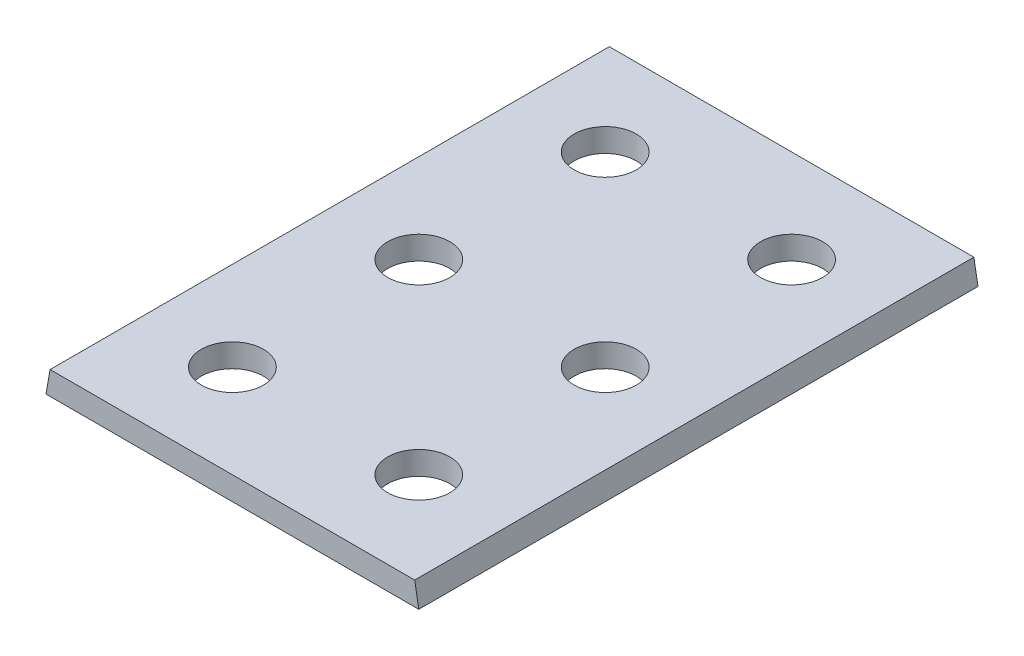
ISO-10303-21;
HEADER;
FILE_DESCRIPTION(('STEP AP214'),'2;1');
FILE_NAME('part.step','',(''),(''),'','','');
FILE_SCHEMA(('AUTOMOTIVE_DESIGN { 1 0 10303 214 1 1 1 1 }'));
ENDSEC;
DATA;
#1=APPLICATION_CONTEXT('core data for automotive mechanical design processes');
#2=APPLICATION_PROTOCOL_DEFINITION('international standard','automotive_design',2000,#1);
#3=PRODUCT_CONTEXT('',#1,'mechanical');
#4=PRODUCT('Part','Part','',(#3));
#5=PRODUCT_RELATED_PRODUCT_CATEGORY('part','',(#4));
#6=PRODUCT_DEFINITION_FORMATION('','',#4);
#7=PRODUCT_DEFINITION_CONTEXT('part definition',#1,'design');
#8=PRODUCT_DEFINITION('design','',#6,#7);
#9=PRODUCT_DEFINITION_SHAPE('','',#8);
#10=(LENGTH_UNIT() NAMED_UNIT(*) SI_UNIT(.MILLI.,.METRE.));
#11=(NAMED_UNIT(*) PLANE_ANGLE_UNIT() SI_UNIT($,.RADIAN.));
#12=(NAMED_UNIT(*) SI_UNIT($,.STERADIAN.) SOLID_ANGLE_UNIT());
#13=UNCERTAINTY_MEASURE_WITH_UNIT(LENGTH_MEASURE(1.E-05),#10,'distance_accuracy_value','');
#14=(GEOMETRIC_REPRESENTATION_CONTEXT(3) GLOBAL_UNCERTAINTY_ASSIGNED_CONTEXT((#13)) GLOBAL_UNIT_ASSIGNED_CONTEXT((#10,
#11,#12)) REPRESENTATION_CONTEXT('',''));
#15=CARTESIAN_POINT('',(0.,0.,0.));
#16=DIRECTION('',(0.,0.,1.));
#17=DIRECTION('',(1.,0.,0.));
#18=AXIS2_PLACEMENT_3D('',#15,#16,#17);
#19=CARTESIAN_POINT('',(0.,6.75,0.));
#20=DIRECTION('',(0.,-1.,0.));
#21=DIRECTION('',(0.,0.,-1.));
#22=AXIS2_PLACEMENT_3D('',#19,#20,#21);
#23=PLANE('',#22);
#24=DIRECTION('',(1.,0.,0.));
#25=VECTOR('',#24,1.);
#26=CARTESIAN_POINT('',(-45.4205607476636,6.75,63.588785046729));
#27=LINE('',#26,#25);
#28=CARTESIAN_POINT('',(-44.2303536278814,6.75,63.588785046729));
#29=VERTEX_POINT('',#28);
#30=CARTESIAN_POINT('',(61.3892321325543,6.75,63.588785046729));
#31=VERTEX_POINT('',#30);
#32=EDGE_CURVE('E89',#29,#31,#27,.T.);
#33=ORIENTED_EDGE('',*,*,#32,.T.);
#34=DIRECTION('',(0.,0.,-1.));
#35=VECTOR('',#34,1.);
#36=CARTESIAN_POINT('',(61.3892321325543,6.75,0.));
#37=LINE('',#36,#35);
#38=CARTESIAN_POINT('',(61.3892321325543,6.75,-98.411214953271));
#39=VERTEX_POINT('',#38);
#40=EDGE_CURVE('E113',#31,#39,#37,.T.);
#41=ORIENTED_EDGE('',*,*,#40,.T.);
#42=DIRECTION('',(-1.,0.,0.));
#43=VECTOR('',#42,1.);
#44=CARTESIAN_POINT('',(-45.4205607476636,6.75,-98.411214953271));
#45=LINE('',#44,#43);
#46=CARTESIAN_POINT('',(-44.2303536278814,6.75,-98.411214953271));
#47=VERTEX_POINT('',#46);
#48=EDGE_CURVE('E106',#39,#47,#45,.T.);
#49=ORIENTED_EDGE('',*,*,#48,.T.);
#50=DIRECTION('',(0.,0.,1.));
#51=VECTOR('',#50,1.);
#52=CARTESIAN_POINT('',(-44.2303536278814,6.75,0.));
#53=LINE('',#52,#51);
#54=EDGE_CURVE('E111',#47,#29,#53,.T.);
#55=ORIENTED_EDGE('',*,*,#54,.T.);
#56=EDGE_LOOP('',(#33,#41,#49,#55));
#57=FACE_BOUND('',#56,.T.);
#58=CARTESIAN_POINT('',(-18.4205607476636,6.75,36.588785046729));
#59=DIRECTION('',(0.,1.,0.));
#60=DIRECTION('',(0.,0.,1.));
#61=AXIS2_PLACEMENT_3D('',#58,#59,#60);
#62=CIRCLE('',#61,9.);
#63=CARTESIAN_POINT('',(-18.4205607476636,6.75,45.588785046729));
#64=VERTEX_POINT('',#63);
#65=EDGE_CURVE('E102',#64,#64,#62,.T.);
#66=ORIENTED_EDGE('',*,*,#65,.F.);
#67=EDGE_LOOP('',(#66));
#68=FACE_BOUND('',#67,.T.);
#69=CARTESIAN_POINT('',(-18.4205607476636,6.75,-17.411214953271));
#70=DIRECTION('',(0.,1.,0.));
#71=DIRECTION('',(0.,0.,1.));
#72=AXIS2_PLACEMENT_3D('',#69,#70,#71);
#73=CIRCLE('',#72,9.);
#74=CARTESIAN_POINT('',(-18.4205607476636,6.75,-8.41121495327099));
#75=VERTEX_POINT('',#74);
#76=EDGE_CURVE('E123',#75,#75,#73,.T.);
#77=ORIENTED_EDGE('',*,*,#76,.F.);
#78=EDGE_LOOP('',(#77));
#79=FACE_BOUND('',#78,.T.);
#80=CARTESIAN_POINT('',(35.5794392523364,6.75,-71.411214953271));
#81=DIRECTION('',(0.,1.,0.));
#82=DIRECTION('',(0.,0.,-1.));
#83=AXIS2_PLACEMENT_3D('',#80,#81,#82);
#84=CIRCLE('',#83,9.);
#85=CARTESIAN_POINT('',(35.5794392523364,6.75,-80.411214953271));
#86=VERTEX_POINT('',#85);
#87=EDGE_CURVE('E129',#86,#86,#84,.T.);
#88=ORIENTED_EDGE('',*,*,#87,.F.);
#89=EDGE_LOOP('',(#88));
#90=FACE_BOUND('',#89,.T.);
#91=CARTESIAN_POINT('',(-18.4205607476636,6.75,-71.411214953271));
#92=DIRECTION('',(0.,1.,0.));
#93=DIRECTION('',(0.,0.,1.));
#94=AXIS2_PLACEMENT_3D('',#91,#92,#93);
#95=CIRCLE('',#94,9.);
#96=CARTESIAN_POINT('',(-18.4205607476636,6.75,-62.411214953271));
#97=VERTEX_POINT('',#96);
#98=EDGE_CURVE('E135',#97,#97,#95,.T.);
#99=ORIENTED_EDGE('',*,*,#98,.F.);
#100=EDGE_LOOP('',(#99));
#101=FACE_BOUND('',#100,.T.);
#102=CARTESIAN_POINT('',(35.5794392523364,6.75,-17.411214953271));
#103=DIRECTION('',(0.,1.,0.));
#104=DIRECTION('',(0.,0.,-1.));
#105=AXIS2_PLACEMENT_3D('',#102,#103,#104);
#106=CIRCLE('',#105,9.);
#107=CARTESIAN_POINT('',(35.5794392523364,6.75,-26.411214953271));
#108=VERTEX_POINT('',#107);
#109=EDGE_CURVE('E141',#108,#108,#106,.T.);
#110=ORIENTED_EDGE('',*,*,#109,.F.);
#111=EDGE_LOOP('',(#110));
#112=FACE_BOUND('',#111,.T.);
#113=CARTESIAN_POINT('',(35.5794392523364,6.75,36.588785046729));
#114=DIRECTION('',(0.,1.,0.));
#115=DIRECTION('',(0.,0.,-1.));
#116=AXIS2_PLACEMENT_3D('',#113,#114,#115);
#117=CIRCLE('',#116,9.);
#118=CARTESIAN_POINT('',(35.5794392523364,6.75,27.588785046729));
#119=VERTEX_POINT('',#118);
#120=EDGE_CURVE('E147',#119,#119,#117,.T.);
#121=ORIENTED_EDGE('',*,*,#120,.F.);
#122=EDGE_LOOP('',(#121));
#123=FACE_BOUND('',#122,.T.);
#124=ADVANCED_FACE('F42',(#57,#68,#79,#90,#101,#112,#123),#23,.F.);
#125=CARTESIAN_POINT('',(0.,0.,0.));
#126=DIRECTION('',(0.,-1.,0.));
#127=DIRECTION('',(0.,0.,-1.));
#128=AXIS2_PLACEMENT_3D('',#125,#126,#127);
#129=PLANE('',#128);
#130=CARTESIAN_POINT('',(35.5794392523364,0.,-17.411214953271));
#131=DIRECTION('',(0.,1.,0.));
#132=DIRECTION('',(0.,0.,-1.));
#133=AXIS2_PLACEMENT_3D('',#130,#131,#132);
#134=CIRCLE('',#133,9.);
#135=CARTESIAN_POINT('',(35.5794392523364,0.,-26.411214953271));
#136=VERTEX_POINT('',#135);
#137=EDGE_CURVE('E144',#136,#136,#134,.T.);
#138=ORIENTED_EDGE('',*,*,#137,.T.);
#139=EDGE_LOOP('',(#138));
#140=FACE_BOUND('',#139,.T.);
#141=CARTESIAN_POINT('',(35.5794392523364,0.,-71.411214953271));
#142=DIRECTION('',(0.,1.,0.));
#143=DIRECTION('',(0.,0.,-1.));
#144=AXIS2_PLACEMENT_3D('',#141,#142,#143);
#145=CIRCLE('',#144,9.);
#146=CARTESIAN_POINT('',(35.5794392523364,0.,-80.411214953271));
#147=VERTEX_POINT('',#146);
#148=EDGE_CURVE('E132',#147,#147,#145,.T.);
#149=ORIENTED_EDGE('',*,*,#148,.T.);
#150=EDGE_LOOP('',(#149));
#151=FACE_BOUND('',#150,.T.);
#152=CARTESIAN_POINT('',(-18.4205607476636,0.,36.588785046729));
#153=DIRECTION('',(0.,1.,0.));
#154=DIRECTION('',(0.,0.,1.));
#155=AXIS2_PLACEMENT_3D('',#152,#153,#154);
#156=CIRCLE('',#155,9.);
#157=CARTESIAN_POINT('',(-18.4205607476636,0.,45.588785046729));
#158=VERTEX_POINT('',#157);
#159=EDGE_CURVE('E120',#158,#158,#156,.T.);
#160=ORIENTED_EDGE('',*,*,#159,.T.);
#161=EDGE_LOOP('',(#160));
#162=FACE_BOUND('',#161,.T.);
#163=DIRECTION('',(1.,0.,0.));
#164=VECTOR('',#163,1.);
#165=CARTESIAN_POINT('',(-18.4205607476636,0.,63.588785046729));
#166=LINE('',#165,#164);
#167=CARTESIAN_POINT('',(-45.4205607476636,0.,63.588785046729));
#168=VERTEX_POINT('',#167);
#169=CARTESIAN_POINT('',(62.5794392523364,0.,63.588785046729));
#170=VERTEX_POINT('',#169);
#171=EDGE_CURVE('E86',#168,#170,#166,.T.);
#172=ORIENTED_EDGE('',*,*,#171,.F.);
#173=DIRECTION('',(0.,0.,1.));
#174=VECTOR('',#173,1.);
#175=CARTESIAN_POINT('',(-45.4205607476636,0.,-98.411214953271));
#176=LINE('',#175,#174);
#177=CARTESIAN_POINT('',(-45.4205607476636,0.,-98.411214953271));
#178=VERTEX_POINT('',#177);
#179=EDGE_CURVE('E99',#178,#168,#176,.T.);
#180=ORIENTED_EDGE('',*,*,#179,.F.);
#181=DIRECTION('',(-1.,0.,0.));
#182=VECTOR('',#181,1.);
#183=CARTESIAN_POINT('',(-45.4205607476636,0.,-98.411214953271));
#184=LINE('',#183,#182);
#185=CARTESIAN_POINT('',(62.5794392523364,0.,-98.411214953271));
#186=VERTEX_POINT('',#185);
#187=EDGE_CURVE('E104',#186,#178,#184,.T.);
#188=ORIENTED_EDGE('',*,*,#187,.F.);
#189=DIRECTION('',(0.,0.,-1.));
#190=VECTOR('',#189,1.);
#191=CARTESIAN_POINT('',(62.5794392523364,0.,63.588785046729));
#192=LINE('',#191,#190);
#193=EDGE_CURVE('E100',#170,#186,#192,.T.);
#194=ORIENTED_EDGE('',*,*,#193,.F.);
#195=EDGE_LOOP('',(#172,#180,#188,#194));
#196=FACE_BOUND('',#195,.T.);
#197=CARTESIAN_POINT('',(-18.4205607476636,0.,-17.411214953271));
#198=DIRECTION('',(0.,1.,0.));
#199=DIRECTION('',(0.,0.,1.));
#200=AXIS2_PLACEMENT_3D('',#197,#198,#199);
#201=CIRCLE('',#200,9.);
#202=CARTESIAN_POINT('',(-18.4205607476636,0.,-8.41121495327099));
#203=VERTEX_POINT('',#202);
#204=EDGE_CURVE('E126',#203,#203,#201,.T.);
#205=ORIENTED_EDGE('',*,*,#204,.T.);
#206=EDGE_LOOP('',(#205));
#207=FACE_BOUND('',#206,.T.);
#208=CARTESIAN_POINT('',(-18.4205607476636,0.,-71.411214953271));
#209=DIRECTION('',(0.,1.,0.));
#210=DIRECTION('',(0.,0.,1.));
#211=AXIS2_PLACEMENT_3D('',#208,#209,#210);
#212=CIRCLE('',#211,9.);
#213=CARTESIAN_POINT('',(-18.4205607476636,0.,-62.411214953271));
#214=VERTEX_POINT('',#213);
#215=EDGE_CURVE('E138',#214,#214,#212,.T.);
#216=ORIENTED_EDGE('',*,*,#215,.T.);
#217=EDGE_LOOP('',(#216));
#218=FACE_BOUND('',#217,.T.);
#219=CARTESIAN_POINT('',(35.5794392523364,0.,36.588785046729));
#220=DIRECTION('',(0.,1.,0.));
#221=DIRECTION('',(0.,0.,-1.));
#222=AXIS2_PLACEMENT_3D('',#219,#220,#221);
#223=CIRCLE('',#222,9.);
#224=CARTESIAN_POINT('',(35.5794392523364,0.,27.588785046729));
#225=VERTEX_POINT('',#224);
#226=EDGE_CURVE('E150',#225,#225,#223,.T.);
#227=ORIENTED_EDGE('',*,*,#226,.T.);
#228=EDGE_LOOP('',(#227));
#229=FACE_BOUND('',#228,.T.);
#230=ADVANCED_FACE('F96',(#140,#151,#162,#196,#207,#218,#229),#129,.T.);
#231=CARTESIAN_POINT('',(-18.4205607476636,6.75,63.588785046729));
#232=DIRECTION('',(0.,0.,-1.));
#233=DIRECTION('',(-1.,0.,0.));
#234=AXIS2_PLACEMENT_3D('',#231,#232,#233);
#235=PLANE('',#234);
#236=ORIENTED_EDGE('',*,*,#171,.T.);
#237=DIRECTION('',(0.173648177666926,-0.984807753012209,0.));
#238=VECTOR('',#237,1.);
#239=CARTESIAN_POINT('',(61.3892321325543,6.75,63.588785046729));
#240=LINE('',#239,#238);
#241=EDGE_CURVE('E11',#170,#31,#240,.F.);
#242=ORIENTED_EDGE('',*,*,#241,.T.);
#243=ORIENTED_EDGE('',*,*,#32,.F.);
#244=DIRECTION('',(0.173648177666928,0.984807753012208,0.));
#245=VECTOR('',#244,1.);
#246=CARTESIAN_POINT('',(-44.2303536278814,6.75,63.588785046729));
#247=LINE('',#246,#245);
#248=EDGE_CURVE('E51',#29,#168,#247,.F.);
#249=ORIENTED_EDGE('',*,*,#248,.T.);
#250=EDGE_LOOP('',(#236,#242,#243,#249));
#251=FACE_BOUND('',#250,.T.);
#252=ADVANCED_FACE('F85',(#251),#235,.F.);
#253=CARTESIAN_POINT('',(-45.4205607476636,6.75,-98.411214953271));
#254=DIRECTION('',(0.,0.,1.));
#255=DIRECTION('',(1.,0.,0.));
#256=AXIS2_PLACEMENT_3D('',#253,#254,#255);
#257=PLANE('',#256);
#258=ORIENTED_EDGE('',*,*,#48,.F.);
#259=DIRECTION('',(-0.173648177666926,0.984807753012209,0.));
#260=VECTOR('',#259,1.);
#261=CARTESIAN_POINT('',(61.3892321325543,6.75,-98.411214953271));
#262=LINE('',#261,#260);
#263=EDGE_CURVE('E66',#39,#186,#262,.F.);
#264=ORIENTED_EDGE('',*,*,#263,.T.);
#265=ORIENTED_EDGE('',*,*,#187,.T.);
#266=DIRECTION('',(-0.173648177666928,-0.984807753012208,0.));
#267=VECTOR('',#266,1.);
#268=CARTESIAN_POINT('',(-44.2303536278814,6.75,-98.411214953271));
#269=LINE('',#268,#267);
#270=EDGE_CURVE('E58',#178,#47,#269,.F.);
#271=ORIENTED_EDGE('',*,*,#270,.T.);
#272=EDGE_LOOP('',(#258,#264,#265,#271));
#273=FACE_BOUND('',#272,.T.);
#274=ADVANCED_FACE('F116',(#273),#257,.F.);
#275=CARTESIAN_POINT('',(-18.4205607476636,6.75,36.588785046729));
#276=DIRECTION('',(0.,-1.,0.));
#277=DIRECTION('',(0.,0.,-1.));
#278=AXIS2_PLACEMENT_3D('',#275,#276,#277);
#279=CYLINDRICAL_SURFACE('',#278,9.);
#280=ORIENTED_EDGE('',*,*,#65,.T.);
#281=EDGE_LOOP('',(#280));
#282=FACE_BOUND('',#281,.T.);
#283=ORIENTED_EDGE('',*,*,#159,.F.);
#284=EDGE_LOOP('',(#283));
#285=FACE_BOUND('',#284,.T.);
#286=ADVANCED_FACE('F169',(#282,#285),#279,.F.);
#287=CARTESIAN_POINT('',(-18.4205607476636,6.75,-17.411214953271));
#288=DIRECTION('',(0.,-1.,0.));
#289=DIRECTION('',(0.,0.,-1.));
#290=AXIS2_PLACEMENT_3D('',#287,#288,#289);
#291=CYLINDRICAL_SURFACE('',#290,9.);
#292=ORIENTED_EDGE('',*,*,#76,.T.);
#293=EDGE_LOOP('',(#292));
#294=FACE_BOUND('',#293,.T.);
#295=ORIENTED_EDGE('',*,*,#204,.F.);
#296=EDGE_LOOP('',(#295));
#297=FACE_BOUND('',#296,.T.);
#298=ADVANCED_FACE('F197',(#294,#297),#291,.F.);
#299=CARTESIAN_POINT('',(35.5794392523364,6.75,-71.411214953271));
#300=DIRECTION('',(0.,-1.,0.));
#301=DIRECTION('',(0.,0.,-1.));
#302=AXIS2_PLACEMENT_3D('',#299,#300,#301);
#303=CYLINDRICAL_SURFACE('',#302,9.);
#304=ORIENTED_EDGE('',*,*,#87,.T.);
#305=EDGE_LOOP('',(#304));
#306=FACE_BOUND('',#305,.T.);
#307=ORIENTED_EDGE('',*,*,#148,.F.);
#308=EDGE_LOOP('',(#307));
#309=FACE_BOUND('',#308,.T.);
#310=ADVANCED_FACE('F194',(#306,#309),#303,.F.);
#311=CARTESIAN_POINT('',(-18.4205607476636,6.75,-71.411214953271));
#312=DIRECTION('',(0.,-1.,0.));
#313=DIRECTION('',(0.,0.,-1.));
#314=AXIS2_PLACEMENT_3D('',#311,#312,#313);
#315=CYLINDRICAL_SURFACE('',#314,9.);
#316=ORIENTED_EDGE('',*,*,#98,.T.);
#317=EDGE_LOOP('',(#316));
#318=FACE_BOUND('',#317,.T.);
#319=ORIENTED_EDGE('',*,*,#215,.F.);
#320=EDGE_LOOP('',(#319));
#321=FACE_BOUND('',#320,.T.);
#322=ADVANCED_FACE('F188',(#318,#321),#315,.F.);
#323=CARTESIAN_POINT('',(35.5794392523364,6.75,-17.411214953271));
#324=DIRECTION('',(0.,-1.,0.));
#325=DIRECTION('',(0.,0.,-1.));
#326=AXIS2_PLACEMENT_3D('',#323,#324,#325);
#327=CYLINDRICAL_SURFACE('',#326,9.);
#328=ORIENTED_EDGE('',*,*,#109,.T.);
#329=EDGE_LOOP('',(#328));
#330=FACE_BOUND('',#329,.T.);
#331=ORIENTED_EDGE('',*,*,#137,.F.);
#332=EDGE_LOOP('',(#331));
#333=FACE_BOUND('',#332,.T.);
#334=ADVANCED_FACE('F183',(#330,#333),#327,.F.);
#335=CARTESIAN_POINT('',(35.5794392523364,6.75,36.588785046729));
#336=DIRECTION('',(0.,-1.,0.));
#337=DIRECTION('',(0.,0.,-1.));
#338=AXIS2_PLACEMENT_3D('',#335,#336,#337);
#339=CYLINDRICAL_SURFACE('',#338,9.);
#340=ORIENTED_EDGE('',*,*,#120,.T.);
#341=EDGE_LOOP('',(#340));
#342=FACE_BOUND('',#341,.T.);
#343=ORIENTED_EDGE('',*,*,#226,.F.);
#344=EDGE_LOOP('',(#343));
#345=FACE_BOUND('',#344,.T.);
#346=ADVANCED_FACE('F156',(#342,#345),#339,.F.);
#347=CARTESIAN_POINT('',(61.3892321325543,6.75,0.));
#348=DIRECTION('',(-0.984807753012209,-0.173648177666926,0.));
#349=DIRECTION('',(0.,0.,-1.));
#350=AXIS2_PLACEMENT_3D('',#347,#348,#349);
#351=PLANE('',#350);
#352=ORIENTED_EDGE('',*,*,#241,.F.);
#353=ORIENTED_EDGE('',*,*,#193,.T.);
#354=ORIENTED_EDGE('',*,*,#263,.F.);
#355=ORIENTED_EDGE('',*,*,#40,.F.);
#356=EDGE_LOOP('',(#352,#353,#354,#355));
#357=FACE_BOUND('',#356,.T.);
#358=ADVANCED_FACE('F117',(#357),#351,.F.);
#359=CARTESIAN_POINT('',(-44.2303536278814,6.75,0.));
#360=DIRECTION('',(0.984807753012208,-0.173648177666928,0.));
#361=DIRECTION('',(0.,0.,1.));
#362=AXIS2_PLACEMENT_3D('',#359,#360,#361);
#363=PLANE('',#362);
#364=ORIENTED_EDGE('',*,*,#270,.F.);
#365=ORIENTED_EDGE('',*,*,#179,.T.);
#366=ORIENTED_EDGE('',*,*,#248,.F.);
#367=ORIENTED_EDGE('',*,*,#54,.F.);
#368=EDGE_LOOP('',(#364,#365,#366,#367));
#369=FACE_BOUND('',#368,.T.);
#370=ADVANCED_FACE('F45',(#369),#363,.F.);
#371=CLOSED_SHELL('',(#124,#230,#252,#274,#286,#298,#310,#322,#334,#346,#358,#370));
#372=MANIFOLD_SOLID_BREP('B2',#371);
#373=ADVANCED_BREP_SHAPE_REPRESENTATION('',(#18,#372),#14);
#374=SHAPE_DEFINITION_REPRESENTATION(#9,#373);
ENDSEC;
END-ISO-10303-21;
